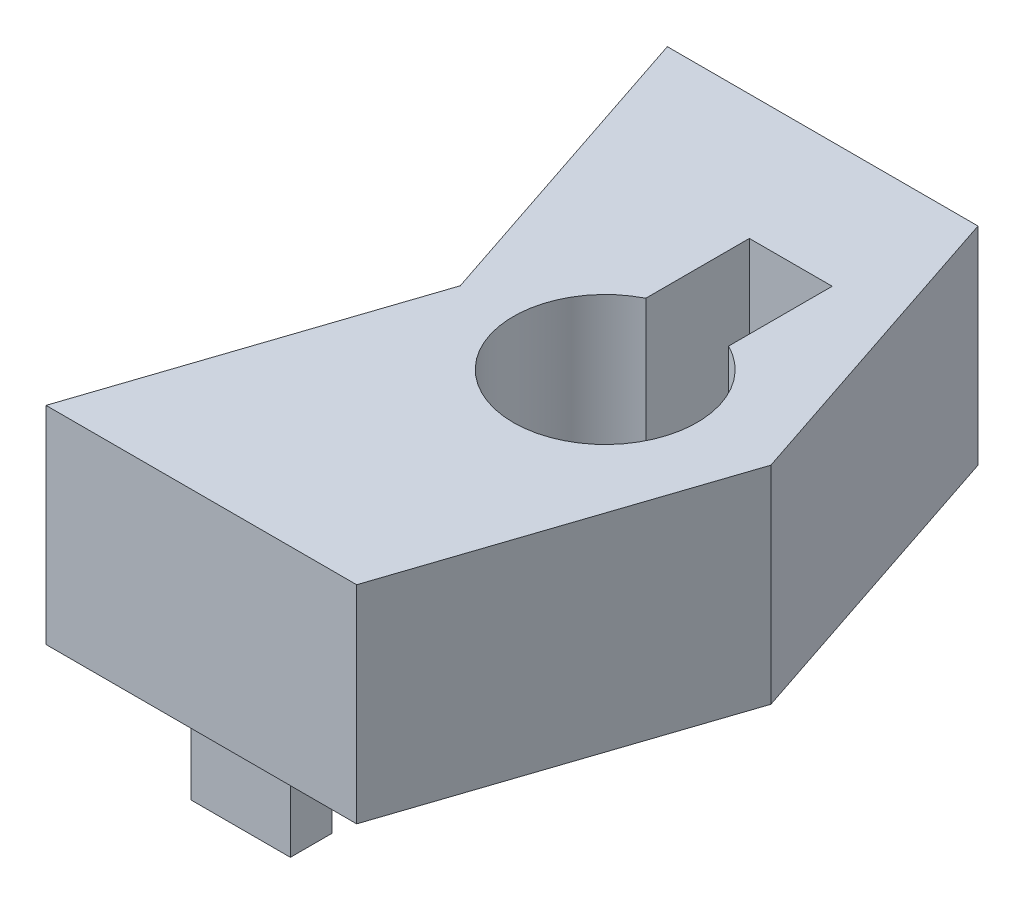
ISO-10303-21;
HEADER;
FILE_DESCRIPTION(('STEP AP214'),'2;1');
FILE_NAME('part.step','',(''),(''),'','','');
FILE_SCHEMA(('AUTOMOTIVE_DESIGN { 1 0 10303 214 1 1 1 1 }'));
ENDSEC;
DATA;
#1=APPLICATION_CONTEXT('core data for automotive mechanical design processes');
#2=APPLICATION_PROTOCOL_DEFINITION('international standard','automotive_design',2000,#1);
#3=PRODUCT_CONTEXT('',#1,'mechanical');
#4=PRODUCT('Part','Part','',(#3));
#5=PRODUCT_RELATED_PRODUCT_CATEGORY('part','',(#4));
#6=PRODUCT_DEFINITION_FORMATION('','',#4);
#7=PRODUCT_DEFINITION_CONTEXT('part definition',#1,'design');
#8=PRODUCT_DEFINITION('design','',#6,#7);
#9=PRODUCT_DEFINITION_SHAPE('','',#8);
#10=(LENGTH_UNIT() NAMED_UNIT(*) SI_UNIT(.MILLI.,.METRE.));
#11=(NAMED_UNIT(*) PLANE_ANGLE_UNIT() SI_UNIT($,.RADIAN.));
#12=(NAMED_UNIT(*) SI_UNIT($,.STERADIAN.) SOLID_ANGLE_UNIT());
#13=UNCERTAINTY_MEASURE_WITH_UNIT(LENGTH_MEASURE(1.E-05),#10,'distance_accuracy_value','');
#14=(GEOMETRIC_REPRESENTATION_CONTEXT(3) GLOBAL_UNCERTAINTY_ASSIGNED_CONTEXT((#13)) GLOBAL_UNIT_ASSIGNED_CONTEXT((#10,
#11,#12)) REPRESENTATION_CONTEXT('',''));
#15=CARTESIAN_POINT('',(0.,0.,0.));
#16=DIRECTION('',(0.,0.,1.));
#17=DIRECTION('',(1.,0.,0.));
#18=AXIS2_PLACEMENT_3D('',#15,#16,#17);
#19=CARTESIAN_POINT('',(0.,0.,0.));
#20=DIRECTION('',(0.,1.,0.));
#21=DIRECTION('',(0.,0.,1.));
#22=AXIS2_PLACEMENT_3D('',#19,#20,#21);
#23=PLANE('',#22);
#24=DIRECTION('',(1.,0.,0.));
#25=VECTOR('',#24,1.);
#26=CARTESIAN_POINT('',(13.716,0.,-1.27000000000001));
#27=LINE('',#26,#25);
#28=CARTESIAN_POINT('',(7.62,0.,-1.27));
#29=VERTEX_POINT('',#28);
#30=CARTESIAN_POINT('',(13.716,0.,-1.27000000000001));
#31=VERTEX_POINT('',#30);
#32=EDGE_CURVE('E206',#29,#31,#27,.T.);
#33=ORIENTED_EDGE('',*,*,#32,.T.);
#34=DIRECTION('',(0.,0.,-1.));
#35=VECTOR('',#34,1.);
#36=CARTESIAN_POINT('',(13.716,0.,-1.27000000000001));
#37=LINE('',#36,#35);
#38=CARTESIAN_POINT('',(13.716,0.,-3.81000000000001));
#39=VERTEX_POINT('',#38);
#40=EDGE_CURVE('E180',#31,#39,#37,.T.);
#41=ORIENTED_EDGE('',*,*,#40,.T.);
#42=DIRECTION('',(-1.,0.,0.));
#43=VECTOR('',#42,1.);
#44=CARTESIAN_POINT('',(13.716,0.,-3.81000000000001));
#45=LINE('',#44,#43);
#46=CARTESIAN_POINT('',(7.62,0.,-3.81000000000001));
#47=VERTEX_POINT('',#46);
#48=EDGE_CURVE('E196',#39,#47,#45,.T.);
#49=ORIENTED_EDGE('',*,*,#48,.T.);
#50=DIRECTION('',(0.,0.,1.));
#51=VECTOR('',#50,1.);
#52=CARTESIAN_POINT('',(7.62,0.,-1.27));
#53=LINE('',#52,#51);
#54=EDGE_CURVE('E58',#47,#29,#53,.T.);
#55=ORIENTED_EDGE('',*,*,#54,.T.);
#56=EDGE_LOOP('',(#33,#41,#49,#55));
#57=FACE_BOUND('',#56,.T.);
#58=DIRECTION('',(-0.316227766016838,0.,0.948683298050514));
#59=VECTOR('',#58,1.);
#60=CARTESIAN_POINT('',(6.35,0.,-19.05));
#61=LINE('',#60,#59);
#62=CARTESIAN_POINT('',(6.35,0.,-19.05));
#63=VERTEX_POINT('',#62);
#64=CARTESIAN_POINT('',(0.,0.,0.));
#65=VERTEX_POINT('',#64);
#66=EDGE_CURVE('E279',#63,#65,#61,.T.);
#67=ORIENTED_EDGE('',*,*,#66,.F.);
#68=DIRECTION('',(0.316227766016838,0.,0.948683298050514));
#69=VECTOR('',#68,1.);
#70=CARTESIAN_POINT('',(0.,0.,-38.1));
#71=LINE('',#70,#69);
#72=CARTESIAN_POINT('',(0.,0.,-38.1));
#73=VERTEX_POINT('',#72);
#74=EDGE_CURVE('E286',#73,#63,#71,.T.);
#75=ORIENTED_EDGE('',*,*,#74,.F.);
#76=DIRECTION('',(-1.,0.,0.));
#77=VECTOR('',#76,1.);
#78=CARTESIAN_POINT('',(19.05,0.,-38.1));
#79=LINE('',#78,#77);
#80=CARTESIAN_POINT('',(19.05,0.,-38.1));
#81=VERTEX_POINT('',#80);
#82=EDGE_CURVE('E305',#81,#73,#79,.T.);
#83=ORIENTED_EDGE('',*,*,#82,.F.);
#84=DIRECTION('',(-0.316227766016838,0.,-0.948683298050514));
#85=VECTOR('',#84,1.);
#86=CARTESIAN_POINT('',(25.4,0.,-19.05));
#87=LINE('',#86,#85);
#88=CARTESIAN_POINT('',(25.4,0.,-19.05));
#89=VERTEX_POINT('',#88);
#90=EDGE_CURVE('E303',#89,#81,#87,.T.);
#91=ORIENTED_EDGE('',*,*,#90,.F.);
#92=DIRECTION('',(0.316227766016838,0.,-0.948683298050514));
#93=VECTOR('',#92,1.);
#94=CARTESIAN_POINT('',(19.05,0.,0.));
#95=LINE('',#94,#93);
#96=CARTESIAN_POINT('',(19.05,0.,0.));
#97=VERTEX_POINT('',#96);
#98=EDGE_CURVE('E301',#97,#89,#95,.T.);
#99=ORIENTED_EDGE('',*,*,#98,.F.);
#100=DIRECTION('',(1.,0.,0.));
#101=VECTOR('',#100,1.);
#102=CARTESIAN_POINT('',(0.,0.,0.));
#103=LINE('',#102,#101);
#104=EDGE_CURVE('E299',#65,#97,#103,.T.);
#105=ORIENTED_EDGE('',*,*,#104,.F.);
#106=EDGE_LOOP('',(#67,#75,#83,#91,#99,#105));
#107=FACE_BOUND('',#106,.T.);
#108=DIRECTION('',(-1.,0.,0.));
#109=VECTOR('',#108,1.);
#110=CARTESIAN_POINT('',(17.78,0.,-24.0800721040468));
#111=LINE('',#110,#109);
#112=CARTESIAN_POINT('',(17.78,0.,-24.0800721040468));
#113=VERTEX_POINT('',#112);
#114=CARTESIAN_POINT('',(12.7,0.,-24.0800721040468));
#115=VERTEX_POINT('',#114);
#116=EDGE_CURVE('E257',#113,#115,#111,.T.);
#117=ORIENTED_EDGE('',*,*,#116,.F.);
#118=DIRECTION('',(0.,0.,1.));
#119=VECTOR('',#118,1.);
#120=CARTESIAN_POINT('',(17.78,0.,-24.0800721040468));
#121=LINE('',#120,#119);
#122=CARTESIAN_POINT('',(17.78,0.,-30.4300721040468));
#123=VERTEX_POINT('',#122);
#124=EDGE_CURVE('E244',#123,#113,#121,.T.);
#125=ORIENTED_EDGE('',*,*,#124,.F.);
#126=DIRECTION('',(1.,0.,0.));
#127=VECTOR('',#126,1.);
#128=CARTESIAN_POINT('',(17.78,0.,-30.4300721040468));
#129=LINE('',#128,#127);
#130=CARTESIAN_POINT('',(12.7,0.,-30.4300721040468));
#131=VERTEX_POINT('',#130);
#132=EDGE_CURVE('E249',#131,#123,#129,.T.);
#133=ORIENTED_EDGE('',*,*,#132,.F.);
#134=DIRECTION('',(0.,0.,-1.));
#135=VECTOR('',#134,1.);
#136=CARTESIAN_POINT('',(12.7,0.,-24.0800721040468));
#137=LINE('',#136,#135);
#138=EDGE_CURVE('E260',#115,#131,#137,.T.);
#139=ORIENTED_EDGE('',*,*,#138,.F.);
#140=EDGE_LOOP('',(#117,#125,#133,#139));
#141=FACE_BOUND('',#140,.T.);
#142=DIRECTION('',(0.,0.,1.));
#143=VECTOR('',#142,1.);
#144=CARTESIAN_POINT('',(13.716,0.,-36.83));
#145=LINE('',#144,#143);
#146=CARTESIAN_POINT('',(13.716,0.,-36.83));
#147=VERTEX_POINT('',#146);
#148=CARTESIAN_POINT('',(13.716,0.,-34.29));
#149=VERTEX_POINT('',#148);
#150=EDGE_CURVE('E185',#147,#149,#145,.T.);
#151=ORIENTED_EDGE('',*,*,#150,.F.);
#152=DIRECTION('',(1.,0.,0.));
#153=VECTOR('',#152,1.);
#154=CARTESIAN_POINT('',(13.716,0.,-36.83));
#155=LINE('',#154,#153);
#156=CARTESIAN_POINT('',(7.62,0.,-36.83));
#157=VERTEX_POINT('',#156);
#158=EDGE_CURVE('E219',#157,#147,#155,.T.);
#159=ORIENTED_EDGE('',*,*,#158,.F.);
#160=DIRECTION('',(0.,0.,-1.));
#161=VECTOR('',#160,1.);
#162=CARTESIAN_POINT('',(7.62,0.,-36.83));
#163=LINE('',#162,#161);
#164=CARTESIAN_POINT('',(7.62,0.,-34.29));
#165=VERTEX_POINT('',#164);
#166=EDGE_CURVE('E229',#165,#157,#163,.T.);
#167=ORIENTED_EDGE('',*,*,#166,.F.);
#168=DIRECTION('',(-1.,0.,0.));
#169=VECTOR('',#168,1.);
#170=CARTESIAN_POINT('',(13.716,0.,-34.29));
#171=LINE('',#170,#169);
#172=EDGE_CURVE('E66',#149,#165,#171,.T.);
#173=ORIENTED_EDGE('',*,*,#172,.F.);
#174=EDGE_LOOP('',(#151,#159,#167,#173));
#175=FACE_BOUND('',#174,.T.);
#176=ADVANCED_FACE('F43',(#57,#107,#141,#175),#23,.F.);
#177=CARTESIAN_POINT('',(6.35,12.7,-19.05));
#178=DIRECTION('',(0.948683298050514,0.,0.316227766016838));
#179=DIRECTION('',(0.316227766016838,0.,-0.948683298050514));
#180=AXIS2_PLACEMENT_3D('',#177,#178,#179);
#181=PLANE('',#180);
#182=ORIENTED_EDGE('',*,*,#66,.T.);
#183=DIRECTION('',(0.,-1.,0.));
#184=VECTOR('',#183,1.);
#185=CARTESIAN_POINT('',(0.,12.7,0.));
#186=LINE('',#185,#184);
#187=CARTESIAN_POINT('',(0.,12.7,0.));
#188=VERTEX_POINT('',#187);
#189=EDGE_CURVE('E51',#188,#65,#186,.T.);
#190=ORIENTED_EDGE('',*,*,#189,.F.);
#191=DIRECTION('',(-0.316227766016838,0.,0.948683298050514));
#192=VECTOR('',#191,1.);
#193=CARTESIAN_POINT('',(6.35,12.7,-19.05));
#194=LINE('',#193,#192);
#195=CARTESIAN_POINT('',(6.35,12.7,-19.05));
#196=VERTEX_POINT('',#195);
#197=EDGE_CURVE('E282',#196,#188,#194,.T.);
#198=ORIENTED_EDGE('',*,*,#197,.F.);
#199=DIRECTION('',(0.,-1.,0.));
#200=VECTOR('',#199,1.);
#201=CARTESIAN_POINT('',(6.35,12.7,-19.05));
#202=LINE('',#201,#200);
#203=EDGE_CURVE('E296',#196,#63,#202,.T.);
#204=ORIENTED_EDGE('',*,*,#203,.T.);
#205=EDGE_LOOP('',(#182,#190,#198,#204));
#206=FACE_BOUND('',#205,.T.);
#207=ADVANCED_FACE('F45',(#206),#181,.F.);
#208=CARTESIAN_POINT('',(0.,12.7,0.));
#209=DIRECTION('',(0.,0.,-1.));
#210=DIRECTION('',(-1.,0.,0.));
#211=AXIS2_PLACEMENT_3D('',#208,#209,#210);
#212=PLANE('',#211);
#213=ORIENTED_EDGE('',*,*,#104,.T.);
#214=DIRECTION('',(0.,-1.,0.));
#215=VECTOR('',#214,1.);
#216=CARTESIAN_POINT('',(19.05,12.7,0.));
#217=LINE('',#216,#215);
#218=CARTESIAN_POINT('',(19.05,12.7,0.));
#219=VERTEX_POINT('',#218);
#220=EDGE_CURVE('E319',#219,#97,#217,.T.);
#221=ORIENTED_EDGE('',*,*,#220,.F.);
#222=DIRECTION('',(1.,0.,0.));
#223=VECTOR('',#222,1.);
#224=CARTESIAN_POINT('',(0.,12.7,0.));
#225=LINE('',#224,#223);
#226=EDGE_CURVE('E285',#188,#219,#225,.T.);
#227=ORIENTED_EDGE('',*,*,#226,.F.);
#228=ORIENTED_EDGE('',*,*,#189,.T.);
#229=EDGE_LOOP('',(#213,#221,#227,#228));
#230=FACE_BOUND('',#229,.T.);
#231=ADVANCED_FACE('F324',(#230),#212,.F.);
#232=CARTESIAN_POINT('',(19.05,12.7,0.));
#233=DIRECTION('',(-0.948683298050514,0.,-0.316227766016838));
#234=DIRECTION('',(-0.316227766016838,0.,0.948683298050514));
#235=AXIS2_PLACEMENT_3D('',#232,#233,#234);
#236=PLANE('',#235);
#237=ORIENTED_EDGE('',*,*,#98,.T.);
#238=DIRECTION('',(0.,-1.,0.));
#239=VECTOR('',#238,1.);
#240=CARTESIAN_POINT('',(25.4,12.7,-19.05));
#241=LINE('',#240,#239);
#242=CARTESIAN_POINT('',(25.4,12.7,-19.05));
#243=VERTEX_POINT('',#242);
#244=EDGE_CURVE('E316',#243,#89,#241,.T.);
#245=ORIENTED_EDGE('',*,*,#244,.F.);
#246=DIRECTION('',(0.316227766016838,0.,-0.948683298050514));
#247=VECTOR('',#246,1.);
#248=CARTESIAN_POINT('',(19.05,12.7,0.));
#249=LINE('',#248,#247);
#250=EDGE_CURVE('E288',#219,#243,#249,.T.);
#251=ORIENTED_EDGE('',*,*,#250,.F.);
#252=ORIENTED_EDGE('',*,*,#220,.T.);
#253=EDGE_LOOP('',(#237,#245,#251,#252));
#254=FACE_BOUND('',#253,.T.);
#255=ADVANCED_FACE('F338',(#254),#236,.F.);
#256=CARTESIAN_POINT('',(25.4,12.7,-19.05));
#257=DIRECTION('',(-0.948683298050514,0.,0.316227766016838));
#258=DIRECTION('',(0.316227766016838,0.,0.948683298050514));
#259=AXIS2_PLACEMENT_3D('',#256,#257,#258);
#260=PLANE('',#259);
#261=ORIENTED_EDGE('',*,*,#90,.T.);
#262=DIRECTION('',(0.,-1.,0.));
#263=VECTOR('',#262,1.);
#264=CARTESIAN_POINT('',(19.05,12.7,-38.1));
#265=LINE('',#264,#263);
#266=CARTESIAN_POINT('',(19.05,12.7,-38.1));
#267=VERTEX_POINT('',#266);
#268=EDGE_CURVE('E313',#267,#81,#265,.T.);
#269=ORIENTED_EDGE('',*,*,#268,.F.);
#270=DIRECTION('',(-0.316227766016838,0.,-0.948683298050514));
#271=VECTOR('',#270,1.);
#272=CARTESIAN_POINT('',(25.4,12.7,-19.05));
#273=LINE('',#272,#271);
#274=EDGE_CURVE('E290',#243,#267,#273,.T.);
#275=ORIENTED_EDGE('',*,*,#274,.F.);
#276=ORIENTED_EDGE('',*,*,#244,.T.);
#277=EDGE_LOOP('',(#261,#269,#275,#276));
#278=FACE_BOUND('',#277,.T.);
#279=ADVANCED_FACE('F342',(#278),#260,.F.);
#280=CARTESIAN_POINT('',(19.05,12.7,-38.1));
#281=DIRECTION('',(0.,0.,1.));
#282=DIRECTION('',(1.,0.,0.));
#283=AXIS2_PLACEMENT_3D('',#280,#281,#282);
#284=PLANE('',#283);
#285=ORIENTED_EDGE('',*,*,#82,.T.);
#286=DIRECTION('',(0.,-1.,0.));
#287=VECTOR('',#286,1.);
#288=CARTESIAN_POINT('',(0.,12.7,-38.1));
#289=LINE('',#288,#287);
#290=CARTESIAN_POINT('',(0.,12.7,-38.1));
#291=VERTEX_POINT('',#290);
#292=EDGE_CURVE('E310',#291,#73,#289,.T.);
#293=ORIENTED_EDGE('',*,*,#292,.F.);
#294=DIRECTION('',(-1.,0.,0.));
#295=VECTOR('',#294,1.);
#296=CARTESIAN_POINT('',(19.05,12.7,-38.1));
#297=LINE('',#296,#295);
#298=EDGE_CURVE('E292',#267,#291,#297,.T.);
#299=ORIENTED_EDGE('',*,*,#298,.F.);
#300=ORIENTED_EDGE('',*,*,#268,.T.);
#301=EDGE_LOOP('',(#285,#293,#299,#300));
#302=FACE_BOUND('',#301,.T.);
#303=ADVANCED_FACE('F352',(#302),#284,.F.);
#304=CARTESIAN_POINT('',(0.,12.7,-38.1));
#305=DIRECTION('',(0.948683298050514,0.,-0.316227766016838));
#306=DIRECTION('',(-0.316227766016838,0.,-0.948683298050514));
#307=AXIS2_PLACEMENT_3D('',#304,#305,#306);
#308=PLANE('',#307);
#309=ORIENTED_EDGE('',*,*,#74,.T.);
#310=ORIENTED_EDGE('',*,*,#203,.F.);
#311=DIRECTION('',(0.316227766016838,0.,0.948683298050514));
#312=VECTOR('',#311,1.);
#313=CARTESIAN_POINT('',(0.,12.7,-38.1));
#314=LINE('',#313,#312);
#315=EDGE_CURVE('E294',#291,#196,#314,.T.);
#316=ORIENTED_EDGE('',*,*,#315,.F.);
#317=ORIENTED_EDGE('',*,*,#292,.T.);
#318=EDGE_LOOP('',(#309,#310,#316,#317));
#319=FACE_BOUND('',#318,.T.);
#320=ADVANCED_FACE('F350',(#319),#308,.F.);
#321=CARTESIAN_POINT('',(0.,12.7,0.));
#322=DIRECTION('',(0.,1.,0.));
#323=DIRECTION('',(0.,0.,1.));
#324=AXIS2_PLACEMENT_3D('',#321,#322,#323);
#325=PLANE('',#324);
#326=DIRECTION('',(0.,0.,1.));
#327=VECTOR('',#326,1.);
#328=CARTESIAN_POINT('',(17.78,12.7,-24.0800721040468));
#329=LINE('',#328,#327);
#330=CARTESIAN_POINT('',(17.78,12.7,-30.4300721040468));
#331=VERTEX_POINT('',#330);
#332=CARTESIAN_POINT('',(17.78,12.7,-24.0800721040468));
#333=VERTEX_POINT('',#332);
#334=EDGE_CURVE('E245',#331,#333,#329,.T.);
#335=ORIENTED_EDGE('',*,*,#334,.T.);
#336=CARTESIAN_POINT('',(15.24,12.7,-19.05));
#337=DIRECTION('',(0.,-1.,0.));
#338=DIRECTION('',(0.,0.,-1.));
#339=AXIS2_PLACEMENT_3D('',#336,#337,#338);
#340=CIRCLE('',#339,5.635000033);
#341=CARTESIAN_POINT('',(12.7,12.7,-24.0800721040468));
#342=VERTEX_POINT('',#341);
#343=EDGE_CURVE('E267',#333,#342,#340,.T.);
#344=ORIENTED_EDGE('',*,*,#343,.T.);
#345=DIRECTION('',(0.,0.,-1.));
#346=VECTOR('',#345,1.);
#347=CARTESIAN_POINT('',(12.7,12.7,-24.0800721040468));
#348=LINE('',#347,#346);
#349=CARTESIAN_POINT('',(12.7,12.7,-30.4300721040468));
#350=VERTEX_POINT('',#349);
#351=EDGE_CURVE('E248',#342,#350,#348,.T.);
#352=ORIENTED_EDGE('',*,*,#351,.T.);
#353=DIRECTION('',(1.,0.,0.));
#354=VECTOR('',#353,1.);
#355=CARTESIAN_POINT('',(17.78,12.7,-30.4300721040468));
#356=LINE('',#355,#354);
#357=EDGE_CURVE('E252',#350,#331,#356,.T.);
#358=ORIENTED_EDGE('',*,*,#357,.T.);
#359=EDGE_LOOP('',(#335,#344,#352,#358));
#360=FACE_BOUND('',#359,.T.);
#361=ORIENTED_EDGE('',*,*,#197,.T.);
#362=ORIENTED_EDGE('',*,*,#226,.T.);
#363=ORIENTED_EDGE('',*,*,#250,.T.);
#364=ORIENTED_EDGE('',*,*,#274,.T.);
#365=ORIENTED_EDGE('',*,*,#298,.T.);
#366=ORIENTED_EDGE('',*,*,#315,.T.);
#367=EDGE_LOOP('',(#361,#362,#363,#364,#365,#366));
#368=FACE_BOUND('',#367,.T.);
#369=ADVANCED_FACE('F346',(#360,#368),#325,.T.);
#370=CARTESIAN_POINT('',(15.24,3.142000066,-19.05));
#371=DIRECTION('',(0.,1.,0.));
#372=DIRECTION('',(0.,0.,1.));
#373=AXIS2_PLACEMENT_3D('',#370,#371,#372);
#374=CYLINDRICAL_SURFACE('',#373,5.635000033);
#375=DIRECTION('',(0.,-1.,0.));
#376=VECTOR('',#375,1.);
#377=CARTESIAN_POINT('',(17.78,12.7,-24.0800721040468));
#378=LINE('',#377,#376);
#379=CARTESIAN_POINT('',(17.78,3.142000066,-24.0800721040468));
#380=VERTEX_POINT('',#379);
#381=EDGE_CURVE('E273',#333,#380,#378,.T.);
#382=ORIENTED_EDGE('',*,*,#381,.T.);
#383=CARTESIAN_POINT('',(15.24,3.142000066,-19.05));
#384=DIRECTION('',(0.,-1.,0.));
#385=DIRECTION('',(0.,0.,-1.));
#386=AXIS2_PLACEMENT_3D('',#383,#384,#385);
#387=CIRCLE('',#386,5.635000033);
#388=CARTESIAN_POINT('',(12.7,3.142000066,-24.0800721040468));
#389=VERTEX_POINT('',#388);
#390=EDGE_CURVE('E276',#380,#389,#387,.T.);
#391=ORIENTED_EDGE('',*,*,#390,.T.);
#392=DIRECTION('',(0.,-1.,0.));
#393=VECTOR('',#392,1.);
#394=CARTESIAN_POINT('',(12.7,12.7,-24.0800721040468));
#395=LINE('',#394,#393);
#396=EDGE_CURVE('E270',#342,#389,#395,.T.);
#397=ORIENTED_EDGE('',*,*,#396,.F.);
#398=ORIENTED_EDGE('',*,*,#343,.F.);
#399=EDGE_LOOP('',(#382,#391,#397,#398));
#400=FACE_BOUND('',#399,.T.);
#401=ADVANCED_FACE('F370',(#400),#374,.F.);
#402=CARTESIAN_POINT('',(15.24,3.142000066,-19.05));
#403=DIRECTION('',(0.,-1.,0.));
#404=DIRECTION('',(0.,0.,-1.));
#405=AXIS2_PLACEMENT_3D('',#402,#403,#404);
#406=PLANE('',#405);
#407=ORIENTED_EDGE('',*,*,#390,.F.);
#408=DIRECTION('',(-1.,0.,0.));
#409=VECTOR('',#408,1.);
#410=CARTESIAN_POINT('',(15.24,3.142000066,-24.0800721040468));
#411=LINE('',#410,#409);
#412=EDGE_CURVE('E12',#380,#389,#411,.T.);
#413=ORIENTED_EDGE('',*,*,#412,.T.);
#414=EDGE_LOOP('',(#407,#413));
#415=FACE_BOUND('',#414,.T.);
#416=ADVANCED_FACE('F374',(#415),#406,.F.);
#417=CARTESIAN_POINT('',(17.78,12.7,-24.0800721040468));
#418=DIRECTION('',(0.,0.,1.));
#419=DIRECTION('',(1.,0.,0.));
#420=AXIS2_PLACEMENT_3D('',#417,#418,#419);
#421=PLANE('',#420);
#422=EDGE_CURVE('E255',#380,#113,#378,.T.);
#423=ORIENTED_EDGE('',*,*,#422,.T.);
#424=ORIENTED_EDGE('',*,*,#116,.T.);
#425=EDGE_CURVE('E272',#389,#115,#395,.T.);
#426=ORIENTED_EDGE('',*,*,#425,.F.);
#427=ORIENTED_EDGE('',*,*,#412,.F.);
#428=EDGE_LOOP('',(#423,#424,#426,#427));
#429=FACE_BOUND('',#428,.T.);
#430=ADVANCED_FACE('F378',(#429),#421,.F.);
#431=CARTESIAN_POINT('',(17.78,12.7,-24.0800721040468));
#432=DIRECTION('',(1.,0.,0.));
#433=DIRECTION('',(0.,0.,-1.));
#434=AXIS2_PLACEMENT_3D('',#431,#432,#433);
#435=PLANE('',#434);
#436=ORIENTED_EDGE('',*,*,#124,.T.);
#437=ORIENTED_EDGE('',*,*,#422,.F.);
#438=ORIENTED_EDGE('',*,*,#381,.F.);
#439=ORIENTED_EDGE('',*,*,#334,.F.);
#440=DIRECTION('',(0.,-1.,0.));
#441=VECTOR('',#440,1.);
#442=CARTESIAN_POINT('',(17.78,12.7,-30.4300721040468));
#443=LINE('',#442,#441);
#444=EDGE_CURVE('E265',#331,#123,#443,.T.);
#445=ORIENTED_EDGE('',*,*,#444,.T.);
#446=EDGE_LOOP('',(#436,#437,#438,#439,#445));
#447=FACE_BOUND('',#446,.T.);
#448=ADVANCED_FACE('F380',(#447),#435,.F.);
#449=CARTESIAN_POINT('',(17.78,12.7,-30.4300721040468));
#450=DIRECTION('',(0.,0.,-1.));
#451=DIRECTION('',(-1.,0.,0.));
#452=AXIS2_PLACEMENT_3D('',#449,#450,#451);
#453=PLANE('',#452);
#454=ORIENTED_EDGE('',*,*,#132,.T.);
#455=ORIENTED_EDGE('',*,*,#444,.F.);
#456=ORIENTED_EDGE('',*,*,#357,.F.);
#457=DIRECTION('',(0.,-1.,0.));
#458=VECTOR('',#457,1.);
#459=CARTESIAN_POINT('',(12.7,12.7,-30.4300721040468));
#460=LINE('',#459,#458);
#461=EDGE_CURVE('E268',#350,#131,#460,.T.);
#462=ORIENTED_EDGE('',*,*,#461,.T.);
#463=EDGE_LOOP('',(#454,#455,#456,#462));
#464=FACE_BOUND('',#463,.T.);
#465=ADVANCED_FACE('F383',(#464),#453,.F.);
#466=CARTESIAN_POINT('',(12.7,12.7,-24.0800721040468));
#467=DIRECTION('',(-1.,0.,0.));
#468=DIRECTION('',(0.,0.,1.));
#469=AXIS2_PLACEMENT_3D('',#466,#467,#468);
#470=PLANE('',#469);
#471=ORIENTED_EDGE('',*,*,#138,.T.);
#472=ORIENTED_EDGE('',*,*,#461,.F.);
#473=ORIENTED_EDGE('',*,*,#351,.F.);
#474=ORIENTED_EDGE('',*,*,#396,.T.);
#475=ORIENTED_EDGE('',*,*,#425,.T.);
#476=EDGE_LOOP('',(#471,#472,#473,#474,#475));
#477=FACE_BOUND('',#476,.T.);
#478=ADVANCED_FACE('F388',(#477),#470,.F.);
#479=CARTESIAN_POINT('',(13.716,-5.08,-36.83));
#480=DIRECTION('',(-1.,0.,0.));
#481=DIRECTION('',(0.,0.,1.));
#482=AXIS2_PLACEMENT_3D('',#479,#480,#481);
#483=PLANE('',#482);
#484=ORIENTED_EDGE('',*,*,#150,.T.);
#485=DIRECTION('',(0.,1.,0.));
#486=VECTOR('',#485,1.);
#487=CARTESIAN_POINT('',(13.716,-5.08,-34.29));
#488=LINE('',#487,#486);
#489=CARTESIAN_POINT('',(13.716,-5.08,-34.29));
#490=VERTEX_POINT('',#489);
#491=EDGE_CURVE('E242',#490,#149,#488,.T.);
#492=ORIENTED_EDGE('',*,*,#491,.F.);
#493=DIRECTION('',(0.,0.,1.));
#494=VECTOR('',#493,1.);
#495=CARTESIAN_POINT('',(13.716,-5.08,-36.83));
#496=LINE('',#495,#494);
#497=CARTESIAN_POINT('',(13.716,-5.08,-36.83));
#498=VERTEX_POINT('',#497);
#499=EDGE_CURVE('E215',#498,#490,#496,.T.);
#500=ORIENTED_EDGE('',*,*,#499,.F.);
#501=DIRECTION('',(0.,1.,0.));
#502=VECTOR('',#501,1.);
#503=CARTESIAN_POINT('',(13.716,-5.08,-36.83));
#504=LINE('',#503,#502);
#505=EDGE_CURVE('E225',#498,#147,#504,.T.);
#506=ORIENTED_EDGE('',*,*,#505,.T.);
#507=EDGE_LOOP('',(#484,#492,#500,#506));
#508=FACE_BOUND('',#507,.T.);
#509=ADVANCED_FACE('F391',(#508),#483,.F.);
#510=CARTESIAN_POINT('',(13.716,-5.08,-34.29));
#511=DIRECTION('',(0.,0.,-1.));
#512=DIRECTION('',(-1.,0.,0.));
#513=AXIS2_PLACEMENT_3D('',#510,#511,#512);
#514=PLANE('',#513);
#515=ORIENTED_EDGE('',*,*,#172,.T.);
#516=DIRECTION('',(0.,1.,0.));
#517=VECTOR('',#516,1.);
#518=CARTESIAN_POINT('',(7.62,-5.08,-34.29));
#519=LINE('',#518,#517);
#520=CARTESIAN_POINT('',(7.62,-5.08,-34.29));
#521=VERTEX_POINT('',#520);
#522=EDGE_CURVE('E239',#521,#165,#519,.T.);
#523=ORIENTED_EDGE('',*,*,#522,.F.);
#524=DIRECTION('',(-1.,0.,0.));
#525=VECTOR('',#524,1.);
#526=CARTESIAN_POINT('',(13.716,-5.08,-34.29));
#527=LINE('',#526,#525);
#528=EDGE_CURVE('E218',#490,#521,#527,.T.);
#529=ORIENTED_EDGE('',*,*,#528,.F.);
#530=ORIENTED_EDGE('',*,*,#491,.T.);
#531=EDGE_LOOP('',(#515,#523,#529,#530));
#532=FACE_BOUND('',#531,.T.);
#533=ADVANCED_FACE('F398',(#532),#514,.F.);
#534=CARTESIAN_POINT('',(7.62,-5.08,-36.83));
#535=DIRECTION('',(1.,0.,0.));
#536=DIRECTION('',(0.,0.,-1.));
#537=AXIS2_PLACEMENT_3D('',#534,#535,#536);
#538=PLANE('',#537);
#539=ORIENTED_EDGE('',*,*,#166,.T.);
#540=DIRECTION('',(0.,1.,0.));
#541=VECTOR('',#540,1.);
#542=CARTESIAN_POINT('',(7.62,-5.08,-36.83));
#543=LINE('',#542,#541);
#544=CARTESIAN_POINT('',(7.62,-5.08,-36.83));
#545=VERTEX_POINT('',#544);
#546=EDGE_CURVE('E236',#545,#157,#543,.T.);
#547=ORIENTED_EDGE('',*,*,#546,.F.);
#548=DIRECTION('',(0.,0.,-1.));
#549=VECTOR('',#548,1.);
#550=CARTESIAN_POINT('',(7.62,-5.08,-36.83));
#551=LINE('',#550,#549);
#552=EDGE_CURVE('E221',#521,#545,#551,.T.);
#553=ORIENTED_EDGE('',*,*,#552,.F.);
#554=ORIENTED_EDGE('',*,*,#522,.T.);
#555=EDGE_LOOP('',(#539,#547,#553,#554));
#556=FACE_BOUND('',#555,.T.);
#557=ADVANCED_FACE('F402',(#556),#538,.F.);
#558=CARTESIAN_POINT('',(13.716,-5.08,-36.83));
#559=DIRECTION('',(0.,0.,1.));
#560=DIRECTION('',(1.,0.,0.));
#561=AXIS2_PLACEMENT_3D('',#558,#559,#560);
#562=PLANE('',#561);
#563=ORIENTED_EDGE('',*,*,#158,.T.);
#564=ORIENTED_EDGE('',*,*,#505,.F.);
#565=DIRECTION('',(1.,0.,0.));
#566=VECTOR('',#565,1.);
#567=CARTESIAN_POINT('',(13.716,-5.08,-36.83));
#568=LINE('',#567,#566);
#569=EDGE_CURVE('E223',#545,#498,#568,.T.);
#570=ORIENTED_EDGE('',*,*,#569,.F.);
#571=ORIENTED_EDGE('',*,*,#546,.T.);
#572=EDGE_LOOP('',(#563,#564,#570,#571));
#573=FACE_BOUND('',#572,.T.);
#574=ADVANCED_FACE('F406',(#573),#562,.F.);
#575=CARTESIAN_POINT('',(0.,-5.08,0.));
#576=DIRECTION('',(0.,-1.,0.));
#577=DIRECTION('',(0.,0.,-1.));
#578=AXIS2_PLACEMENT_3D('',#575,#576,#577);
#579=PLANE('',#578);
#580=ORIENTED_EDGE('',*,*,#499,.T.);
#581=ORIENTED_EDGE('',*,*,#528,.T.);
#582=ORIENTED_EDGE('',*,*,#552,.T.);
#583=ORIENTED_EDGE('',*,*,#569,.T.);
#584=EDGE_LOOP('',(#580,#581,#582,#583));
#585=FACE_BOUND('',#584,.T.);
#586=ADVANCED_FACE('F410',(#585),#579,.T.);
#587=CARTESIAN_POINT('',(13.716,-5.08,-1.27000000000001));
#588=DIRECTION('',(1.,0.,0.));
#589=DIRECTION('',(0.,0.,-1.));
#590=AXIS2_PLACEMENT_3D('',#587,#588,#589);
#591=PLANE('',#590);
#592=ORIENTED_EDGE('',*,*,#40,.F.);
#593=DIRECTION('',(0.,1.,0.));
#594=VECTOR('',#593,1.);
#595=CARTESIAN_POINT('',(13.716,-5.08,-1.27000000000001));
#596=LINE('',#595,#594);
#597=CARTESIAN_POINT('',(13.716,-5.08,-1.27000000000001));
#598=VERTEX_POINT('',#597);
#599=EDGE_CURVE('E174',#598,#31,#596,.T.);
#600=ORIENTED_EDGE('',*,*,#599,.F.);
#601=DIRECTION('',(0.,0.,-1.));
#602=VECTOR('',#601,1.);
#603=CARTESIAN_POINT('',(13.716,-5.08,-1.27000000000001));
#604=LINE('',#603,#602);
#605=CARTESIAN_POINT('',(13.716,-5.08,-3.81000000000001));
#606=VERTEX_POINT('',#605);
#607=EDGE_CURVE('E177',#598,#606,#604,.T.);
#608=ORIENTED_EDGE('',*,*,#607,.T.);
#609=DIRECTION('',(0.,1.,0.));
#610=VECTOR('',#609,1.);
#611=CARTESIAN_POINT('',(13.716,-5.08,-3.81000000000001));
#612=LINE('',#611,#610);
#613=EDGE_CURVE('E204',#606,#39,#612,.T.);
#614=ORIENTED_EDGE('',*,*,#613,.T.);
#615=EDGE_LOOP('',(#592,#600,#608,#614));
#616=FACE_BOUND('',#615,.T.);
#617=ADVANCED_FACE('F176',(#616),#591,.T.);
#618=CARTESIAN_POINT('',(13.716,-5.08,-1.27000000000001));
#619=DIRECTION('',(0.,0.,1.));
#620=DIRECTION('',(1.,0.,0.));
#621=AXIS2_PLACEMENT_3D('',#618,#619,#620);
#622=PLANE('',#621);
#623=ORIENTED_EDGE('',*,*,#32,.F.);
#624=DIRECTION('',(0.,1.,0.));
#625=VECTOR('',#624,1.);
#626=CARTESIAN_POINT('',(7.62,-5.08,-1.27));
#627=LINE('',#626,#625);
#628=CARTESIAN_POINT('',(7.62,-5.08,-1.27));
#629=VERTEX_POINT('',#628);
#630=EDGE_CURVE('E186',#629,#29,#627,.T.);
#631=ORIENTED_EDGE('',*,*,#630,.F.);
#632=DIRECTION('',(1.,0.,0.));
#633=VECTOR('',#632,1.);
#634=CARTESIAN_POINT('',(13.716,-5.08,-1.27000000000001));
#635=LINE('',#634,#633);
#636=EDGE_CURVE('E192',#629,#598,#635,.T.);
#637=ORIENTED_EDGE('',*,*,#636,.T.);
#638=ORIENTED_EDGE('',*,*,#599,.T.);
#639=EDGE_LOOP('',(#623,#631,#637,#638));
#640=FACE_BOUND('',#639,.T.);
#641=ADVANCED_FACE('F198',(#640),#622,.T.);
#642=CARTESIAN_POINT('',(7.62,-5.08,-1.27));
#643=DIRECTION('',(-1.,0.,0.));
#644=DIRECTION('',(0.,0.,1.));
#645=AXIS2_PLACEMENT_3D('',#642,#643,#644);
#646=PLANE('',#645);
#647=ORIENTED_EDGE('',*,*,#54,.F.);
#648=DIRECTION('',(0.,1.,0.));
#649=VECTOR('',#648,1.);
#650=CARTESIAN_POINT('',(7.62,-5.08,-3.81));
#651=LINE('',#650,#649);
#652=CARTESIAN_POINT('',(7.62,-5.08,-3.81));
#653=VERTEX_POINT('',#652);
#654=EDGE_CURVE('E212',#653,#47,#651,.T.);
#655=ORIENTED_EDGE('',*,*,#654,.F.);
#656=DIRECTION('',(0.,0.,1.));
#657=VECTOR('',#656,1.);
#658=CARTESIAN_POINT('',(7.62,-5.08,-1.27));
#659=LINE('',#658,#657);
#660=EDGE_CURVE('E199',#653,#629,#659,.T.);
#661=ORIENTED_EDGE('',*,*,#660,.T.);
#662=ORIENTED_EDGE('',*,*,#630,.T.);
#663=EDGE_LOOP('',(#647,#655,#661,#662));
#664=FACE_BOUND('',#663,.T.);
#665=ADVANCED_FACE('F419',(#664),#646,.T.);
#666=CARTESIAN_POINT('',(13.716,-5.08,-3.81000000000001));
#667=DIRECTION('',(0.,0.,-1.));
#668=DIRECTION('',(-1.,0.,0.));
#669=AXIS2_PLACEMENT_3D('',#666,#667,#668);
#670=PLANE('',#669);
#671=ORIENTED_EDGE('',*,*,#48,.F.);
#672=ORIENTED_EDGE('',*,*,#613,.F.);
#673=DIRECTION('',(-1.,0.,0.));
#674=VECTOR('',#673,1.);
#675=CARTESIAN_POINT('',(13.716,-5.08,-3.81000000000001));
#676=LINE('',#675,#674);
#677=EDGE_CURVE('E195',#606,#653,#676,.T.);
#678=ORIENTED_EDGE('',*,*,#677,.T.);
#679=ORIENTED_EDGE('',*,*,#654,.T.);
#680=EDGE_LOOP('',(#671,#672,#678,#679));
#681=FACE_BOUND('',#680,.T.);
#682=ADVANCED_FACE('F422',(#681),#670,.T.);
#683=CARTESIAN_POINT('',(0.,-5.08,-38.1));
#684=DIRECTION('',(0.,-1.,0.));
#685=DIRECTION('',(0.,0.,1.));
#686=AXIS2_PLACEMENT_3D('',#683,#684,#685);
#687=PLANE('',#686);
#688=ORIENTED_EDGE('',*,*,#607,.F.);
#689=ORIENTED_EDGE('',*,*,#636,.F.);
#690=ORIENTED_EDGE('',*,*,#660,.F.);
#691=ORIENTED_EDGE('',*,*,#677,.F.);
#692=EDGE_LOOP('',(#688,#689,#690,#691));
#693=FACE_BOUND('',#692,.T.);
#694=ADVANCED_FACE('F190',(#693),#687,.T.);
#695=CLOSED_SHELL('',(#176,#207,#231,#255,#279,#303,#320,#369,#401,#416,#430,#448,#465,#478,
#509,#533,#557,#574,#586,#617,#641,#665,#682,#694));
#696=MANIFOLD_SOLID_BREP('B2',#695);
#697=ADVANCED_BREP_SHAPE_REPRESENTATION('',(#18,#696),#14);
#698=SHAPE_DEFINITION_REPRESENTATION(#9,#697);
ENDSEC;
END-ISO-10303-21;
